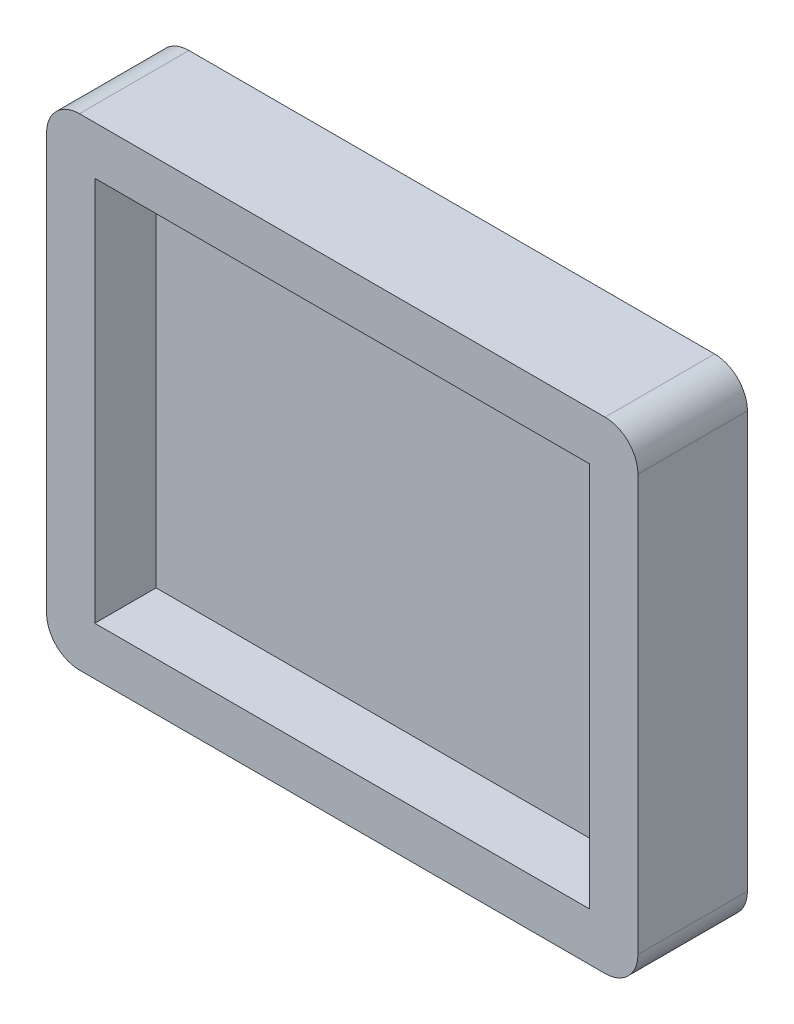
ISO-10303-21;
HEADER;
FILE_DESCRIPTION(('STEP AP214'),'2;1');
FILE_NAME('part.step','',(''),(''),'','','');
FILE_SCHEMA(('AUTOMOTIVE_DESIGN { 1 0 10303 214 1 1 1 1 }'));
ENDSEC;
DATA;
#1=APPLICATION_CONTEXT('core data for automotive mechanical design processes');
#2=APPLICATION_PROTOCOL_DEFINITION('international standard','automotive_design',2000,#1);
#3=PRODUCT_CONTEXT('',#1,'mechanical');
#4=PRODUCT('Part','Part','',(#3));
#5=PRODUCT_RELATED_PRODUCT_CATEGORY('part','',(#4));
#6=PRODUCT_DEFINITION_FORMATION('','',#4);
#7=PRODUCT_DEFINITION_CONTEXT('part definition',#1,'design');
#8=PRODUCT_DEFINITION('design','',#6,#7);
#9=PRODUCT_DEFINITION_SHAPE('','',#8);
#10=(LENGTH_UNIT() NAMED_UNIT(*) SI_UNIT(.MILLI.,.METRE.));
#11=(NAMED_UNIT(*) PLANE_ANGLE_UNIT() SI_UNIT($,.RADIAN.));
#12=(NAMED_UNIT(*) SI_UNIT($,.STERADIAN.) SOLID_ANGLE_UNIT());
#13=UNCERTAINTY_MEASURE_WITH_UNIT(LENGTH_MEASURE(1.E-05),#10,'distance_accuracy_value','');
#14=(GEOMETRIC_REPRESENTATION_CONTEXT(3) GLOBAL_UNCERTAINTY_ASSIGNED_CONTEXT((#13)) GLOBAL_UNIT_ASSIGNED_CONTEXT((#10,
#11,#12)) REPRESENTATION_CONTEXT('',''));
#15=CARTESIAN_POINT('',(0.,0.,0.));
#16=DIRECTION('',(0.,0.,1.));
#17=DIRECTION('',(1.,0.,0.));
#18=AXIS2_PLACEMENT_3D('',#15,#16,#17);
#19=CARTESIAN_POINT('',(0.,0.,0.));
#20=DIRECTION('',(0.,0.,1.));
#21=DIRECTION('',(1.,0.,0.));
#22=AXIS2_PLACEMENT_3D('',#19,#20,#21);
#23=PLANE('',#22);
#24=DIRECTION('',(0.,-1.,0.));
#25=VECTOR('',#24,1.);
#26=CARTESIAN_POINT('',(-11.3,11.,0.));
#27=LINE('',#26,#25);
#28=CARTESIAN_POINT('',(-11.3,8.8,0.));
#29=VERTEX_POINT('',#28);
#30=CARTESIAN_POINT('',(-11.3,-8.8,0.));
#31=VERTEX_POINT('',#30);
#32=EDGE_CURVE('E187',#29,#31,#27,.T.);
#33=ORIENTED_EDGE('',*,*,#32,.F.);
#34=DIRECTION('',(-1.,0.,0.));
#35=VECTOR('',#34,1.);
#36=CARTESIAN_POINT('',(13.5,8.8,0.));
#37=LINE('',#36,#35);
#38=CARTESIAN_POINT('',(11.3,8.8,0.));
#39=VERTEX_POINT('',#38);
#40=EDGE_CURVE('E175',#39,#29,#37,.T.);
#41=ORIENTED_EDGE('',*,*,#40,.F.);
#42=DIRECTION('',(0.,1.,0.));
#43=VECTOR('',#42,1.);
#44=CARTESIAN_POINT('',(11.3,11.,0.));
#45=LINE('',#44,#43);
#46=CARTESIAN_POINT('',(11.3,-8.8,0.));
#47=VERTEX_POINT('',#46);
#48=EDGE_CURVE('E193',#47,#39,#45,.T.);
#49=ORIENTED_EDGE('',*,*,#48,.F.);
#50=DIRECTION('',(1.,0.,0.));
#51=VECTOR('',#50,1.);
#52=CARTESIAN_POINT('',(13.5,-8.8,0.));
#53=LINE('',#52,#51);
#54=EDGE_CURVE('E190',#31,#47,#53,.T.);
#55=ORIENTED_EDGE('',*,*,#54,.F.);
#56=EDGE_LOOP('',(#33,#41,#49,#55));
#57=FACE_BOUND('',#56,.T.);
#58=CARTESIAN_POINT('',(12.,9.5,0.));
#59=DIRECTION('',(0.,0.,1.));
#60=DIRECTION('',(1.,0.,0.));
#61=AXIS2_PLACEMENT_3D('',#58,#59,#60);
#62=CIRCLE('',#61,1.5);
#63=CARTESIAN_POINT('',(12.,11.,0.));
#64=VERTEX_POINT('',#63);
#65=CARTESIAN_POINT('',(13.5,9.5,0.));
#66=VERTEX_POINT('',#65);
#67=EDGE_CURVE('E133',#64,#66,#62,.F.);
#68=ORIENTED_EDGE('',*,*,#67,.F.);
#69=DIRECTION('',(-1.,0.,0.));
#70=VECTOR('',#69,1.);
#71=CARTESIAN_POINT('',(13.5,11.,0.));
#72=LINE('',#71,#70);
#73=CARTESIAN_POINT('',(-12.,11.,0.));
#74=VERTEX_POINT('',#73);
#75=EDGE_CURVE('E129',#64,#74,#72,.T.);
#76=ORIENTED_EDGE('',*,*,#75,.T.);
#77=CARTESIAN_POINT('',(-12.,9.5,0.));
#78=DIRECTION('',(0.,0.,1.));
#79=DIRECTION('',(1.,0.,0.));
#80=AXIS2_PLACEMENT_3D('',#77,#78,#79);
#81=CIRCLE('',#80,1.5);
#82=CARTESIAN_POINT('',(-13.5,9.5,0.));
#83=VERTEX_POINT('',#82);
#84=EDGE_CURVE('E125',#83,#74,#81,.F.);
#85=ORIENTED_EDGE('',*,*,#84,.F.);
#86=DIRECTION('',(0.,-1.,0.));
#87=VECTOR('',#86,1.);
#88=CARTESIAN_POINT('',(-13.5,11.,0.));
#89=LINE('',#88,#87);
#90=CARTESIAN_POINT('',(-13.5,-9.5,0.));
#91=VERTEX_POINT('',#90);
#92=EDGE_CURVE('E126',#83,#91,#89,.T.);
#93=ORIENTED_EDGE('',*,*,#92,.T.);
#94=CARTESIAN_POINT('',(-12.,-9.5,0.));
#95=DIRECTION('',(0.,0.,1.));
#96=DIRECTION('',(1.,0.,0.));
#97=AXIS2_PLACEMENT_3D('',#94,#95,#96);
#98=CIRCLE('',#97,1.5);
#99=CARTESIAN_POINT('',(-12.,-11.,0.));
#100=VERTEX_POINT('',#99);
#101=EDGE_CURVE('E185',#100,#91,#98,.F.);
#102=ORIENTED_EDGE('',*,*,#101,.F.);
#103=DIRECTION('',(1.,0.,0.));
#104=VECTOR('',#103,1.);
#105=CARTESIAN_POINT('',(13.5,-11.,0.));
#106=LINE('',#105,#104);
#107=CARTESIAN_POINT('',(12.,-11.,0.));
#108=VERTEX_POINT('',#107);
#109=EDGE_CURVE('E137',#100,#108,#106,.T.);
#110=ORIENTED_EDGE('',*,*,#109,.T.);
#111=CARTESIAN_POINT('',(12.,-9.5,0.));
#112=DIRECTION('',(0.,0.,1.));
#113=DIRECTION('',(1.,0.,0.));
#114=AXIS2_PLACEMENT_3D('',#111,#112,#113);
#115=CIRCLE('',#114,1.5);
#116=CARTESIAN_POINT('',(13.5,-9.5,0.));
#117=VERTEX_POINT('',#116);
#118=EDGE_CURVE('E183',#117,#108,#115,.F.);
#119=ORIENTED_EDGE('',*,*,#118,.F.);
#120=DIRECTION('',(0.,1.,0.));
#121=VECTOR('',#120,1.);
#122=CARTESIAN_POINT('',(13.5,11.,0.));
#123=LINE('',#122,#121);
#124=EDGE_CURVE('E177',#117,#66,#123,.T.);
#125=ORIENTED_EDGE('',*,*,#124,.T.);
#126=EDGE_LOOP('',(#68,#76,#85,#93,#102,#110,#119,#125));
#127=FACE_BOUND('',#126,.T.);
#128=ADVANCED_FACE('F32',(#57,#127),#23,.T.);
#129=CARTESIAN_POINT('',(13.5,-8.8,5.));
#130=DIRECTION('',(0.,1.,0.));
#131=DIRECTION('',(-1.,0.,0.));
#132=AXIS2_PLACEMENT_3D('',#129,#130,#131);
#133=PLANE('',#132);
#134=DIRECTION('',(0.,0.,1.));
#135=VECTOR('',#134,1.);
#136=CARTESIAN_POINT('',(-11.3,-8.8,5.));
#137=LINE('',#136,#135);
#138=CARTESIAN_POINT('',(-11.3,-8.8,-2.8));
#139=VERTEX_POINT('',#138);
#140=EDGE_CURVE('E160',#139,#31,#137,.T.);
#141=ORIENTED_EDGE('',*,*,#140,.T.);
#142=ORIENTED_EDGE('',*,*,#54,.T.);
#143=DIRECTION('',(0.,0.,1.));
#144=VECTOR('',#143,1.);
#145=CARTESIAN_POINT('',(11.3,-8.8,5.));
#146=LINE('',#145,#144);
#147=CARTESIAN_POINT('',(11.3,-8.8,-2.8));
#148=VERTEX_POINT('',#147);
#149=EDGE_CURVE('E164',#148,#47,#146,.T.);
#150=ORIENTED_EDGE('',*,*,#149,.F.);
#151=DIRECTION('',(1.,0.,0.));
#152=VECTOR('',#151,1.);
#153=CARTESIAN_POINT('',(0.,-8.8,-2.8));
#154=LINE('',#153,#152);
#155=EDGE_CURVE('E163',#139,#148,#154,.T.);
#156=ORIENTED_EDGE('',*,*,#155,.F.);
#157=EDGE_LOOP('',(#141,#142,#150,#156));
#158=FACE_BOUND('',#157,.T.);
#159=ADVANCED_FACE('F223',(#158),#133,.T.);
#160=CARTESIAN_POINT('',(0.,0.,-2.8));
#161=DIRECTION('',(0.,0.,-1.));
#162=DIRECTION('',(-1.,0.,0.));
#163=AXIS2_PLACEMENT_3D('',#160,#161,#162);
#164=PLANE('',#163);
#165=DIRECTION('',(0.,-1.,0.));
#166=VECTOR('',#165,1.);
#167=CARTESIAN_POINT('',(-11.3,0.,-2.8));
#168=LINE('',#167,#166);
#169=CARTESIAN_POINT('',(-11.3,8.8,-2.8));
#170=VERTEX_POINT('',#169);
#171=EDGE_CURVE('E159',#170,#139,#168,.T.);
#172=ORIENTED_EDGE('',*,*,#171,.T.);
#173=ORIENTED_EDGE('',*,*,#155,.T.);
#174=DIRECTION('',(0.,1.,0.));
#175=VECTOR('',#174,1.);
#176=CARTESIAN_POINT('',(11.3,0.,-2.8));
#177=LINE('',#176,#175);
#178=CARTESIAN_POINT('',(11.3,8.8,-2.8));
#179=VERTEX_POINT('',#178);
#180=EDGE_CURVE('E167',#148,#179,#177,.T.);
#181=ORIENTED_EDGE('',*,*,#180,.T.);
#182=DIRECTION('',(-1.,0.,0.));
#183=VECTOR('',#182,1.);
#184=CARTESIAN_POINT('',(0.,8.8,-2.8));
#185=LINE('',#184,#183);
#186=EDGE_CURVE('E171',#179,#170,#185,.T.);
#187=ORIENTED_EDGE('',*,*,#186,.T.);
#188=EDGE_LOOP('',(#172,#173,#181,#187));
#189=FACE_BOUND('',#188,.T.);
#190=ADVANCED_FACE('F214',(#189),#164,.F.);
#191=CARTESIAN_POINT('',(-11.3,11.,5.));
#192=DIRECTION('',(1.,0.,0.));
#193=DIRECTION('',(0.,1.,0.));
#194=AXIS2_PLACEMENT_3D('',#191,#192,#193);
#195=PLANE('',#194);
#196=DIRECTION('',(0.,0.,1.));
#197=VECTOR('',#196,1.);
#198=CARTESIAN_POINT('',(-11.3,8.8,5.));
#199=LINE('',#198,#197);
#200=EDGE_CURVE('E172',#170,#29,#199,.T.);
#201=ORIENTED_EDGE('',*,*,#200,.T.);
#202=ORIENTED_EDGE('',*,*,#32,.T.);
#203=ORIENTED_EDGE('',*,*,#140,.F.);
#204=ORIENTED_EDGE('',*,*,#171,.F.);
#205=EDGE_LOOP('',(#201,#202,#203,#204));
#206=FACE_BOUND('',#205,.T.);
#207=ADVANCED_FACE('F220',(#206),#195,.T.);
#208=CARTESIAN_POINT('',(11.3,11.,5.));
#209=DIRECTION('',(-1.,0.,0.));
#210=DIRECTION('',(0.,-1.,0.));
#211=AXIS2_PLACEMENT_3D('',#208,#209,#210);
#212=PLANE('',#211);
#213=ORIENTED_EDGE('',*,*,#149,.T.);
#214=ORIENTED_EDGE('',*,*,#48,.T.);
#215=DIRECTION('',(0.,0.,1.));
#216=VECTOR('',#215,1.);
#217=CARTESIAN_POINT('',(11.3,8.8,5.));
#218=LINE('',#217,#216);
#219=EDGE_CURVE('E168',#179,#39,#218,.T.);
#220=ORIENTED_EDGE('',*,*,#219,.F.);
#221=ORIENTED_EDGE('',*,*,#180,.F.);
#222=EDGE_LOOP('',(#213,#214,#220,#221));
#223=FACE_BOUND('',#222,.T.);
#224=ADVANCED_FACE('F227',(#223),#212,.T.);
#225=CARTESIAN_POINT('',(13.5,8.8,5.));
#226=DIRECTION('',(0.,-1.,0.));
#227=DIRECTION('',(1.,0.,0.));
#228=AXIS2_PLACEMENT_3D('',#225,#226,#227);
#229=PLANE('',#228);
#230=ORIENTED_EDGE('',*,*,#219,.T.);
#231=ORIENTED_EDGE('',*,*,#40,.T.);
#232=ORIENTED_EDGE('',*,*,#200,.F.);
#233=ORIENTED_EDGE('',*,*,#186,.F.);
#234=EDGE_LOOP('',(#230,#231,#232,#233));
#235=FACE_BOUND('',#234,.T.);
#236=ADVANCED_FACE('F229',(#235),#229,.T.);
#237=CARTESIAN_POINT('',(0.,0.,-5.));
#238=DIRECTION('',(0.,0.,-1.));
#239=DIRECTION('',(-1.,0.,0.));
#240=AXIS2_PLACEMENT_3D('',#237,#238,#239);
#241=PLANE('',#240);
#242=DIRECTION('',(0.,-1.,0.));
#243=VECTOR('',#242,1.);
#244=CARTESIAN_POINT('',(-13.5,11.,-5.));
#245=LINE('',#244,#243);
#246=CARTESIAN_POINT('',(-13.5,9.5,-5.));
#247=VERTEX_POINT('',#246);
#248=CARTESIAN_POINT('',(-13.5,-9.5,-5.));
#249=VERTEX_POINT('',#248);
#250=EDGE_CURVE('E11',#247,#249,#245,.T.);
#251=ORIENTED_EDGE('',*,*,#250,.F.);
#252=CARTESIAN_POINT('',(-12.,9.5,-5.));
#253=DIRECTION('',(0.,0.,-1.));
#254=DIRECTION('',(-1.,0.,0.));
#255=AXIS2_PLACEMENT_3D('',#252,#253,#254);
#256=CIRCLE('',#255,1.5);
#257=CARTESIAN_POINT('',(-12.,11.,-5.));
#258=VERTEX_POINT('',#257);
#259=EDGE_CURVE('E140',#247,#258,#256,.T.);
#260=ORIENTED_EDGE('',*,*,#259,.T.);
#261=DIRECTION('',(-1.,0.,0.));
#262=VECTOR('',#261,1.);
#263=CARTESIAN_POINT('',(13.5,11.,-5.));
#264=LINE('',#263,#262);
#265=CARTESIAN_POINT('',(12.,11.,-5.));
#266=VERTEX_POINT('',#265);
#267=EDGE_CURVE('E141',#266,#258,#264,.T.);
#268=ORIENTED_EDGE('',*,*,#267,.F.);
#269=CARTESIAN_POINT('',(12.,9.5,-5.));
#270=DIRECTION('',(0.,0.,-1.));
#271=DIRECTION('',(-1.,0.,0.));
#272=AXIS2_PLACEMENT_3D('',#269,#270,#271);
#273=CIRCLE('',#272,1.5);
#274=CARTESIAN_POINT('',(13.5,9.5,-5.));
#275=VERTEX_POINT('',#274);
#276=EDGE_CURVE('E205',#266,#275,#273,.T.);
#277=ORIENTED_EDGE('',*,*,#276,.T.);
#278=DIRECTION('',(0.,1.,0.));
#279=VECTOR('',#278,1.);
#280=CARTESIAN_POINT('',(13.5,11.,-5.));
#281=LINE('',#280,#279);
#282=CARTESIAN_POINT('',(13.5,-9.5,-5.));
#283=VERTEX_POINT('',#282);
#284=EDGE_CURVE('E199',#283,#275,#281,.T.);
#285=ORIENTED_EDGE('',*,*,#284,.F.);
#286=CARTESIAN_POINT('',(12.,-9.5,-5.));
#287=DIRECTION('',(0.,0.,-1.));
#288=DIRECTION('',(-1.,0.,0.));
#289=AXIS2_PLACEMENT_3D('',#286,#287,#288);
#290=CIRCLE('',#289,1.5);
#291=CARTESIAN_POINT('',(12.,-11.,-5.));
#292=VERTEX_POINT('',#291);
#293=EDGE_CURVE('E142',#283,#292,#290,.T.);
#294=ORIENTED_EDGE('',*,*,#293,.T.);
#295=DIRECTION('',(1.,0.,0.));
#296=VECTOR('',#295,1.);
#297=CARTESIAN_POINT('',(13.5,-11.,-5.));
#298=LINE('',#297,#296);
#299=CARTESIAN_POINT('',(-12.,-11.,-5.));
#300=VERTEX_POINT('',#299);
#301=EDGE_CURVE('E41',#300,#292,#298,.T.);
#302=ORIENTED_EDGE('',*,*,#301,.F.);
#303=CARTESIAN_POINT('',(-12.,-9.5,-5.));
#304=DIRECTION('',(0.,0.,-1.));
#305=DIRECTION('',(-1.,0.,0.));
#306=AXIS2_PLACEMENT_3D('',#303,#304,#305);
#307=CIRCLE('',#306,1.5);
#308=EDGE_CURVE('E56',#300,#249,#307,.T.);
#309=ORIENTED_EDGE('',*,*,#308,.T.);
#310=EDGE_LOOP('',(#251,#260,#268,#277,#285,#294,#302,#309));
#311=FACE_BOUND('',#310,.T.);
#312=ADVANCED_FACE('F270',(#311),#241,.T.);
#313=CARTESIAN_POINT('',(-13.5,11.,5.));
#314=DIRECTION('',(1.,0.,0.));
#315=DIRECTION('',(0.,1.,0.));
#316=AXIS2_PLACEMENT_3D('',#313,#314,#315);
#317=PLANE('',#316);
#318=ORIENTED_EDGE('',*,*,#92,.F.);
#319=DIRECTION('',(0.,0.,-1.));
#320=VECTOR('',#319,1.);
#321=CARTESIAN_POINT('',(-13.5,9.5,5.));
#322=LINE('',#321,#320);
#323=EDGE_CURVE('E48',#83,#247,#322,.T.);
#324=ORIENTED_EDGE('',*,*,#323,.T.);
#325=ORIENTED_EDGE('',*,*,#250,.T.);
#326=DIRECTION('',(0.,0.,-1.));
#327=VECTOR('',#326,1.);
#328=CARTESIAN_POINT('',(-13.5,-9.5,5.));
#329=LINE('',#328,#327);
#330=EDGE_CURVE('E36',#249,#91,#329,.F.);
#331=ORIENTED_EDGE('',*,*,#330,.T.);
#332=EDGE_LOOP('',(#318,#324,#325,#331));
#333=FACE_BOUND('',#332,.T.);
#334=ADVANCED_FACE('F135',(#333),#317,.F.);
#335=CARTESIAN_POINT('',(13.5,-11.,5.));
#336=DIRECTION('',(0.,1.,0.));
#337=DIRECTION('',(-1.,0.,0.));
#338=AXIS2_PLACEMENT_3D('',#335,#336,#337);
#339=PLANE('',#338);
#340=ORIENTED_EDGE('',*,*,#109,.F.);
#341=DIRECTION('',(0.,0.,-1.));
#342=VECTOR('',#341,1.);
#343=CARTESIAN_POINT('',(-12.,-11.,5.));
#344=LINE('',#343,#342);
#345=EDGE_CURVE('E154',#100,#300,#344,.T.);
#346=ORIENTED_EDGE('',*,*,#345,.T.);
#347=ORIENTED_EDGE('',*,*,#301,.T.);
#348=DIRECTION('',(0.,0.,-1.));
#349=VECTOR('',#348,1.);
#350=CARTESIAN_POINT('',(12.,-11.,5.));
#351=LINE('',#350,#349);
#352=EDGE_CURVE('E156',#292,#108,#351,.F.);
#353=ORIENTED_EDGE('',*,*,#352,.T.);
#354=EDGE_LOOP('',(#340,#346,#347,#353));
#355=FACE_BOUND('',#354,.T.);
#356=ADVANCED_FACE('F269',(#355),#339,.F.);
#357=CARTESIAN_POINT('',(-12.,-9.5,5.));
#358=DIRECTION('',(0.,0.,-1.));
#359=DIRECTION('',(-1.,0.,0.));
#360=AXIS2_PLACEMENT_3D('',#357,#358,#359);
#361=CYLINDRICAL_SURFACE('',#360,1.5);
#362=ORIENTED_EDGE('',*,*,#345,.F.);
#363=ORIENTED_EDGE('',*,*,#101,.T.);
#364=ORIENTED_EDGE('',*,*,#330,.F.);
#365=ORIENTED_EDGE('',*,*,#308,.F.);
#366=EDGE_LOOP('',(#362,#363,#364,#365));
#367=FACE_BOUND('',#366,.T.);
#368=ADVANCED_FACE('F34',(#367),#361,.T.);
#369=CARTESIAN_POINT('',(13.5,11.,5.));
#370=DIRECTION('',(-1.,0.,0.));
#371=DIRECTION('',(0.,-1.,0.));
#372=AXIS2_PLACEMENT_3D('',#369,#370,#371);
#373=PLANE('',#372);
#374=ORIENTED_EDGE('',*,*,#124,.F.);
#375=DIRECTION('',(0.,0.,-1.));
#376=VECTOR('',#375,1.);
#377=CARTESIAN_POINT('',(13.5,-9.5,5.));
#378=LINE('',#377,#376);
#379=EDGE_CURVE('E149',#117,#283,#378,.T.);
#380=ORIENTED_EDGE('',*,*,#379,.T.);
#381=ORIENTED_EDGE('',*,*,#284,.T.);
#382=DIRECTION('',(0.,0.,-1.));
#383=VECTOR('',#382,1.);
#384=CARTESIAN_POINT('',(13.5,9.5,5.));
#385=LINE('',#384,#383);
#386=EDGE_CURVE('E151',#275,#66,#385,.F.);
#387=ORIENTED_EDGE('',*,*,#386,.T.);
#388=EDGE_LOOP('',(#374,#380,#381,#387));
#389=FACE_BOUND('',#388,.T.);
#390=ADVANCED_FACE('F252',(#389),#373,.F.);
#391=CARTESIAN_POINT('',(12.,-9.5,5.));
#392=DIRECTION('',(0.,0.,-1.));
#393=DIRECTION('',(-1.,0.,0.));
#394=AXIS2_PLACEMENT_3D('',#391,#392,#393);
#395=CYLINDRICAL_SURFACE('',#394,1.5);
#396=ORIENTED_EDGE('',*,*,#379,.F.);
#397=ORIENTED_EDGE('',*,*,#118,.T.);
#398=ORIENTED_EDGE('',*,*,#352,.F.);
#399=ORIENTED_EDGE('',*,*,#293,.F.);
#400=EDGE_LOOP('',(#396,#397,#398,#399));
#401=FACE_BOUND('',#400,.T.);
#402=ADVANCED_FACE('F250',(#401),#395,.T.);
#403=CARTESIAN_POINT('',(13.5,11.,5.));
#404=DIRECTION('',(0.,-1.,0.));
#405=DIRECTION('',(1.,0.,0.));
#406=AXIS2_PLACEMENT_3D('',#403,#404,#405);
#407=PLANE('',#406);
#408=ORIENTED_EDGE('',*,*,#75,.F.);
#409=DIRECTION('',(0.,0.,-1.));
#410=VECTOR('',#409,1.);
#411=CARTESIAN_POINT('',(12.,11.,5.));
#412=LINE('',#411,#410);
#413=EDGE_CURVE('E145',#64,#266,#412,.T.);
#414=ORIENTED_EDGE('',*,*,#413,.T.);
#415=ORIENTED_EDGE('',*,*,#267,.T.);
#416=DIRECTION('',(0.,0.,-1.));
#417=VECTOR('',#416,1.);
#418=CARTESIAN_POINT('',(-12.,11.,5.));
#419=LINE('',#418,#417);
#420=EDGE_CURVE('E147',#258,#74,#419,.F.);
#421=ORIENTED_EDGE('',*,*,#420,.T.);
#422=EDGE_LOOP('',(#408,#414,#415,#421));
#423=FACE_BOUND('',#422,.T.);
#424=ADVANCED_FACE('F245',(#423),#407,.F.);
#425=CARTESIAN_POINT('',(12.,9.5,5.));
#426=DIRECTION('',(0.,0.,-1.));
#427=DIRECTION('',(-1.,0.,0.));
#428=AXIS2_PLACEMENT_3D('',#425,#426,#427);
#429=CYLINDRICAL_SURFACE('',#428,1.5);
#430=ORIENTED_EDGE('',*,*,#413,.F.);
#431=ORIENTED_EDGE('',*,*,#67,.T.);
#432=ORIENTED_EDGE('',*,*,#386,.F.);
#433=ORIENTED_EDGE('',*,*,#276,.F.);
#434=EDGE_LOOP('',(#430,#431,#432,#433));
#435=FACE_BOUND('',#434,.T.);
#436=ADVANCED_FACE('F240',(#435),#429,.T.);
#437=CARTESIAN_POINT('',(-12.,9.5,5.));
#438=DIRECTION('',(0.,0.,-1.));
#439=DIRECTION('',(-1.,0.,0.));
#440=AXIS2_PLACEMENT_3D('',#437,#438,#439);
#441=CYLINDRICAL_SURFACE('',#440,1.5);
#442=ORIENTED_EDGE('',*,*,#323,.F.);
#443=ORIENTED_EDGE('',*,*,#84,.T.);
#444=ORIENTED_EDGE('',*,*,#420,.F.);
#445=ORIENTED_EDGE('',*,*,#259,.F.);
#446=EDGE_LOOP('',(#442,#443,#444,#445));
#447=FACE_BOUND('',#446,.T.);
#448=ADVANCED_FACE('F139',(#447),#441,.T.);
#449=CLOSED_SHELL('',(#128,#159,#190,#207,#224,#236,#312,#334,#356,#368,#390,#402,#424,#436,#448));
#450=MANIFOLD_SOLID_BREP('B2',#449);
#451=ADVANCED_BREP_SHAPE_REPRESENTATION('',(#18,#450),#14);
#452=SHAPE_DEFINITION_REPRESENTATION(#9,#451);
ENDSEC;
END-ISO-10303-21;
